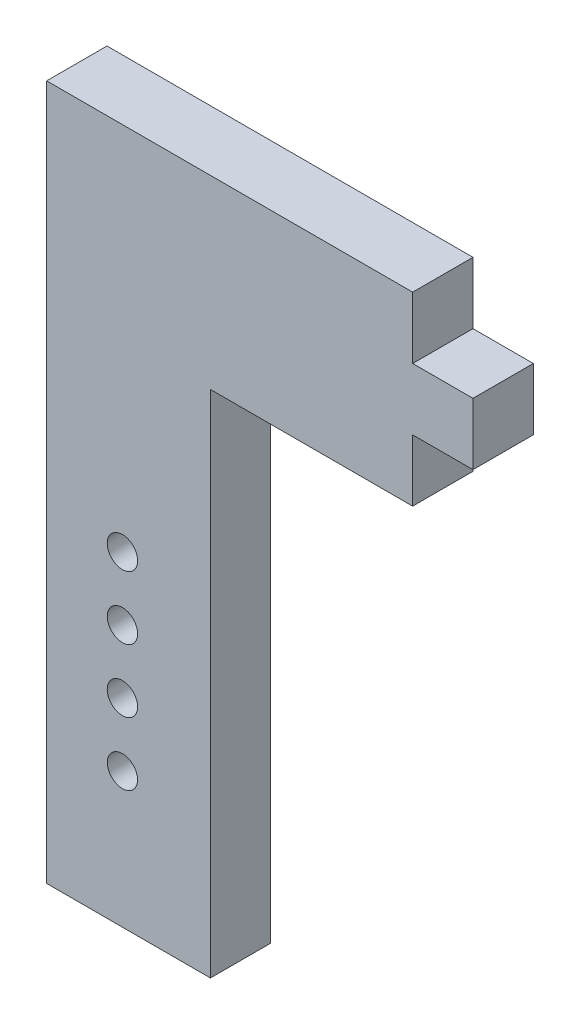
ISO-10303-21;
HEADER;
FILE_DESCRIPTION(('STEP AP214'),'2;1');
FILE_NAME('part.step','',(''),(''),'','','');
FILE_SCHEMA(('AUTOMOTIVE_DESIGN { 1 0 10303 214 1 1 1 1 }'));
ENDSEC;
DATA;
#1=APPLICATION_CONTEXT('core data for automotive mechanical design processes');
#2=APPLICATION_PROTOCOL_DEFINITION('international standard','automotive_design',2000,#1);
#3=PRODUCT_CONTEXT('',#1,'mechanical');
#4=PRODUCT('Part','Part','',(#3));
#5=PRODUCT_RELATED_PRODUCT_CATEGORY('part','',(#4));
#6=PRODUCT_DEFINITION_FORMATION('','',#4);
#7=PRODUCT_DEFINITION_CONTEXT('part definition',#1,'design');
#8=PRODUCT_DEFINITION('design','',#6,#7);
#9=PRODUCT_DEFINITION_SHAPE('','',#8);
#10=(LENGTH_UNIT() NAMED_UNIT(*) SI_UNIT(.MILLI.,.METRE.));
#11=(NAMED_UNIT(*) PLANE_ANGLE_UNIT() SI_UNIT($,.RADIAN.));
#12=(NAMED_UNIT(*) SI_UNIT($,.STERADIAN.) SOLID_ANGLE_UNIT());
#13=UNCERTAINTY_MEASURE_WITH_UNIT(LENGTH_MEASURE(1.E-05),#10,'distance_accuracy_value','');
#14=(GEOMETRIC_REPRESENTATION_CONTEXT(3) GLOBAL_UNCERTAINTY_ASSIGNED_CONTEXT((#13)) GLOBAL_UNIT_ASSIGNED_CONTEXT((#10,
#11,#12)) REPRESENTATION_CONTEXT('',''));
#15=CARTESIAN_POINT('',(0.,0.,0.));
#16=DIRECTION('',(0.,0.,1.));
#17=DIRECTION('',(1.,0.,0.));
#18=AXIS2_PLACEMENT_3D('',#15,#16,#17);
#19=CARTESIAN_POINT('',(-6.731,28.575,4.9609375));
#20=DIRECTION('',(0.,-1.,0.));
#21=DIRECTION('',(0.,0.,-1.));
#22=AXIS2_PLACEMENT_3D('',#19,#20,#21);
#23=PLANE('',#22);
#24=DIRECTION('',(0.,0.,1.));
#25=VECTOR('',#24,1.);
#26=CARTESIAN_POINT('',(23.3600625,28.575,4.9609375));
#27=LINE('',#26,#25);
#28=CARTESIAN_POINT('',(23.3600625,28.575,0.));
#29=VERTEX_POINT('',#28);
#30=CARTESIAN_POINT('',(23.3600625,28.575,4.9609375));
#31=VERTEX_POINT('',#30);
#32=EDGE_CURVE('E134',#29,#31,#27,.T.);
#33=ORIENTED_EDGE('',*,*,#32,.F.);
#34=DIRECTION('',(-1.,0.,0.));
#35=VECTOR('',#34,1.);
#36=CARTESIAN_POINT('',(-6.731,28.575,0.));
#37=LINE('',#36,#35);
#38=CARTESIAN_POINT('',(-6.731,28.575,0.));
#39=VERTEX_POINT('',#38);
#40=EDGE_CURVE('E133',#29,#39,#37,.T.);
#41=ORIENTED_EDGE('',*,*,#40,.T.);
#42=DIRECTION('',(0.,0.,-1.));
#43=VECTOR('',#42,1.);
#44=CARTESIAN_POINT('',(-6.731,28.575,4.9609375));
#45=LINE('',#44,#43);
#46=CARTESIAN_POINT('',(-6.731,28.575,4.9609375));
#47=VERTEX_POINT('',#46);
#48=EDGE_CURVE('E42',#47,#39,#45,.T.);
#49=ORIENTED_EDGE('',*,*,#48,.F.);
#50=DIRECTION('',(-1.,0.,0.));
#51=VECTOR('',#50,1.);
#52=CARTESIAN_POINT('',(-6.731,28.575,4.9609375));
#53=LINE('',#52,#51);
#54=EDGE_CURVE('E174',#31,#47,#53,.T.);
#55=ORIENTED_EDGE('',*,*,#54,.F.);
#56=EDGE_LOOP('',(#33,#41,#49,#55));
#57=FACE_BOUND('',#56,.T.);
#58=ADVANCED_FACE('F34',(#57),#23,.F.);
#59=CARTESIAN_POINT('',(0.,0.,4.9609375));
#60=DIRECTION('',(0.,0.,1.));
#61=DIRECTION('',(1.,0.,0.));
#62=AXIS2_PLACEMENT_3D('',#59,#60,#61);
#63=PLANE('',#62);
#64=DIRECTION('',(1.,0.,0.));
#65=VECTOR('',#64,1.);
#66=CARTESIAN_POINT('',(23.3600625,23.495,4.9609375));
#67=LINE('',#66,#65);
#68=CARTESIAN_POINT('',(23.3600625,23.495,4.9609375));
#69=VERTEX_POINT('',#68);
#70=CARTESIAN_POINT('',(28.321,23.495,4.9609375));
#71=VERTEX_POINT('',#70);
#72=EDGE_CURVE('E57',#69,#71,#67,.T.);
#73=ORIENTED_EDGE('',*,*,#72,.F.);
#74=DIRECTION('',(0.,1.,0.));
#75=VECTOR('',#74,1.);
#76=CARTESIAN_POINT('',(23.3600625,0.,4.9609375));
#77=LINE('',#76,#75);
#78=EDGE_CURVE('E126',#69,#31,#77,.T.);
#79=ORIENTED_EDGE('',*,*,#78,.T.);
#80=ORIENTED_EDGE('',*,*,#54,.T.);
#81=DIRECTION('',(0.,-1.,0.));
#82=VECTOR('',#81,1.);
#83=CARTESIAN_POINT('',(-6.731,28.575,4.9609375));
#84=LINE('',#83,#82);
#85=CARTESIAN_POINT('',(-6.731,-28.575,4.9609375));
#86=VERTEX_POINT('',#85);
#87=EDGE_CURVE('E177',#47,#86,#84,.T.);
#88=ORIENTED_EDGE('',*,*,#87,.T.);
#89=DIRECTION('',(1.,0.,0.));
#90=VECTOR('',#89,1.);
#91=CARTESIAN_POINT('',(-6.731,-28.575,4.9609375));
#92=LINE('',#91,#90);
#93=CARTESIAN_POINT('',(6.731,-28.575,4.9609375));
#94=VERTEX_POINT('',#93);
#95=EDGE_CURVE('E179',#86,#94,#92,.T.);
#96=ORIENTED_EDGE('',*,*,#95,.T.);
#97=DIRECTION('',(0.,1.,0.));
#98=VECTOR('',#97,1.);
#99=CARTESIAN_POINT('',(6.731,28.575,4.9609375));
#100=LINE('',#99,#98);
#101=CARTESIAN_POINT('',(6.731,13.335,4.9609375));
#102=VERTEX_POINT('',#101);
#103=EDGE_CURVE('E171',#94,#102,#100,.T.);
#104=ORIENTED_EDGE('',*,*,#103,.T.);
#105=DIRECTION('',(-1.,0.,0.));
#106=VECTOR('',#105,1.);
#107=CARTESIAN_POINT('',(28.321,13.335,4.9609375));
#108=LINE('',#107,#106);
#109=CARTESIAN_POINT('',(23.3600625,13.335,4.9609375));
#110=VERTEX_POINT('',#109);
#111=EDGE_CURVE('E159',#110,#102,#108,.T.);
#112=ORIENTED_EDGE('',*,*,#111,.F.);
#113=CARTESIAN_POINT('',(23.3600625,18.415,4.9609375));
#114=VERTEX_POINT('',#113);
#115=EDGE_CURVE('E135',#110,#114,#77,.T.);
#116=ORIENTED_EDGE('',*,*,#115,.T.);
#117=DIRECTION('',(1.,0.,0.));
#118=VECTOR('',#117,1.);
#119=CARTESIAN_POINT('',(23.3600625,18.415,4.9609375));
#120=LINE('',#119,#118);
#121=CARTESIAN_POINT('',(28.321,18.415,4.9609375));
#122=VERTEX_POINT('',#121);
#123=EDGE_CURVE('E144',#114,#122,#120,.T.);
#124=ORIENTED_EDGE('',*,*,#123,.T.);
#125=DIRECTION('',(0.,-1.,0.));
#126=VECTOR('',#125,1.);
#127=CARTESIAN_POINT('',(28.321,28.575,4.9609375));
#128=LINE('',#127,#126);
#129=EDGE_CURVE('E157',#71,#122,#128,.T.);
#130=ORIENTED_EDGE('',*,*,#129,.F.);
#131=EDGE_LOOP('',(#73,#79,#80,#88,#96,#104,#112,#116,#124,#130));
#132=FACE_BOUND('',#131,.T.);
#133=CARTESIAN_POINT('',(-0.50215382907749,-1.86249999999999,4.9609375));
#134=DIRECTION('',(0.,0.,-1.));
#135=DIRECTION('',(-1.,0.,0.));
#136=AXIS2_PLACEMENT_3D('',#133,#134,#135);
#137=CIRCLE('',#136,1.24968);
#138=CARTESIAN_POINT('',(-1.75183382907749,-1.86249999999999,4.9609375));
#139=VERTEX_POINT('',#138);
#140=EDGE_CURVE('E379',#139,#139,#137,.T.);
#141=ORIENTED_EDGE('',*,*,#140,.T.);
#142=EDGE_LOOP('',(#141));
#143=FACE_BOUND('',#142,.T.);
#144=CARTESIAN_POINT('',(-0.50215382907749,-7.06249999999999,4.9609375));
#145=DIRECTION('',(0.,0.,-1.));
#146=DIRECTION('',(-1.,0.,0.));
#147=AXIS2_PLACEMENT_3D('',#144,#145,#146);
#148=CIRCLE('',#147,1.24968);
#149=CARTESIAN_POINT('',(-1.75183382907749,-7.06249999999999,4.9609375));
#150=VERTEX_POINT('',#149);
#151=EDGE_CURVE('E369',#150,#150,#148,.T.);
#152=ORIENTED_EDGE('',*,*,#151,.T.);
#153=EDGE_LOOP('',(#152));
#154=FACE_BOUND('',#153,.T.);
#155=CARTESIAN_POINT('',(-0.502153829077487,-17.4625,4.9609375));
#156=DIRECTION('',(0.,0.,-1.));
#157=DIRECTION('',(-1.,0.,0.));
#158=AXIS2_PLACEMENT_3D('',#155,#156,#157);
#159=CIRCLE('',#158,1.2446);
#160=CARTESIAN_POINT('',(-1.74675382907749,-17.4625,4.9609375));
#161=VERTEX_POINT('',#160);
#162=EDGE_CURVE('E364',#161,#161,#159,.T.);
#163=ORIENTED_EDGE('',*,*,#162,.T.);
#164=EDGE_LOOP('',(#163));
#165=FACE_BOUND('',#164,.T.);
#166=CARTESIAN_POINT('',(-0.50215382907749,-12.2625,4.9609375));
#167=DIRECTION('',(0.,0.,-1.));
#168=DIRECTION('',(-1.,0.,0.));
#169=AXIS2_PLACEMENT_3D('',#166,#167,#168);
#170=CIRCLE('',#169,1.25);
#171=CARTESIAN_POINT('',(-1.75215382907749,-12.2625,4.9609375));
#172=VERTEX_POINT('',#171);
#173=EDGE_CURVE('E167',#172,#172,#170,.T.);
#174=ORIENTED_EDGE('',*,*,#173,.T.);
#175=EDGE_LOOP('',(#174));
#176=FACE_BOUND('',#175,.T.);
#177=ADVANCED_FACE('F211',(#132,#143,#154,#165,#176),#63,.T.);
#178=CARTESIAN_POINT('',(0.,0.,0.));
#179=DIRECTION('',(0.,0.,1.));
#180=DIRECTION('',(1.,0.,0.));
#181=AXIS2_PLACEMENT_3D('',#178,#179,#180);
#182=PLANE('',#181);
#183=DIRECTION('',(1.,0.,0.));
#184=VECTOR('',#183,1.);
#185=CARTESIAN_POINT('',(23.3600625,18.415,0.));
#186=LINE('',#185,#184);
#187=CARTESIAN_POINT('',(23.3600625,18.415,0.));
#188=VERTEX_POINT('',#187);
#189=CARTESIAN_POINT('',(28.321,18.415,0.));
#190=VERTEX_POINT('',#189);
#191=EDGE_CURVE('E49',#188,#190,#186,.T.);
#192=ORIENTED_EDGE('',*,*,#191,.F.);
#193=DIRECTION('',(0.,1.,0.));
#194=VECTOR('',#193,1.);
#195=CARTESIAN_POINT('',(23.3600625,0.,0.));
#196=LINE('',#195,#194);
#197=CARTESIAN_POINT('',(23.3600625,13.335,0.));
#198=VERTEX_POINT('',#197);
#199=EDGE_CURVE('E137',#198,#188,#196,.T.);
#200=ORIENTED_EDGE('',*,*,#199,.F.);
#201=DIRECTION('',(-1.,0.,0.));
#202=VECTOR('',#201,1.);
#203=CARTESIAN_POINT('',(28.321,13.335,0.));
#204=LINE('',#203,#202);
#205=CARTESIAN_POINT('',(6.731,13.335,0.));
#206=VERTEX_POINT('',#205);
#207=EDGE_CURVE('E156',#198,#206,#204,.T.);
#208=ORIENTED_EDGE('',*,*,#207,.T.);
#209=DIRECTION('',(0.,1.,0.));
#210=VECTOR('',#209,1.);
#211=CARTESIAN_POINT('',(6.731,28.575,0.));
#212=LINE('',#211,#210);
#213=CARTESIAN_POINT('',(6.731,-28.575,0.));
#214=VERTEX_POINT('',#213);
#215=EDGE_CURVE('E170',#214,#206,#212,.T.);
#216=ORIENTED_EDGE('',*,*,#215,.F.);
#217=DIRECTION('',(1.,0.,0.));
#218=VECTOR('',#217,1.);
#219=CARTESIAN_POINT('',(-6.731,-28.575,0.));
#220=LINE('',#219,#218);
#221=CARTESIAN_POINT('',(-6.731,-28.575,0.));
#222=VERTEX_POINT('',#221);
#223=EDGE_CURVE('E175',#222,#214,#220,.T.);
#224=ORIENTED_EDGE('',*,*,#223,.F.);
#225=DIRECTION('',(0.,-1.,0.));
#226=VECTOR('',#225,1.);
#227=CARTESIAN_POINT('',(-6.731,28.575,0.));
#228=LINE('',#227,#226);
#229=EDGE_CURVE('E185',#39,#222,#228,.T.);
#230=ORIENTED_EDGE('',*,*,#229,.F.);
#231=ORIENTED_EDGE('',*,*,#40,.F.);
#232=CARTESIAN_POINT('',(23.3600625,23.495,0.));
#233=VERTEX_POINT('',#232);
#234=EDGE_CURVE('E123',#233,#29,#196,.T.);
#235=ORIENTED_EDGE('',*,*,#234,.F.);
#236=DIRECTION('',(1.,0.,0.));
#237=VECTOR('',#236,1.);
#238=CARTESIAN_POINT('',(23.3600625,23.495,0.));
#239=LINE('',#238,#237);
#240=CARTESIAN_POINT('',(28.321,23.495,0.));
#241=VERTEX_POINT('',#240);
#242=EDGE_CURVE('E110',#233,#241,#239,.T.);
#243=ORIENTED_EDGE('',*,*,#242,.T.);
#244=DIRECTION('',(0.,1.,0.));
#245=VECTOR('',#244,1.);
#246=CARTESIAN_POINT('',(28.321,28.575,0.));
#247=LINE('',#246,#245);
#248=EDGE_CURVE('E154',#190,#241,#247,.T.);
#249=ORIENTED_EDGE('',*,*,#248,.F.);
#250=EDGE_LOOP('',(#192,#200,#208,#216,#224,#230,#231,#235,#243,#249));
#251=FACE_BOUND('',#250,.T.);
#252=CARTESIAN_POINT('',(-0.50215382907749,-12.2625,0.));
#253=DIRECTION('',(0.,0.,-1.));
#254=DIRECTION('',(-1.,0.,0.));
#255=AXIS2_PLACEMENT_3D('',#252,#253,#254);
#256=CIRCLE('',#255,1.25);
#257=CARTESIAN_POINT('',(-1.75215382907749,-12.2625,0.));
#258=VERTEX_POINT('',#257);
#259=EDGE_CURVE('E371',#258,#258,#256,.T.);
#260=ORIENTED_EDGE('',*,*,#259,.F.);
#261=EDGE_LOOP('',(#260));
#262=FACE_BOUND('',#261,.T.);
#263=CARTESIAN_POINT('',(-0.502153829077487,-17.4625,0.));
#264=DIRECTION('',(0.,0.,-1.));
#265=DIRECTION('',(-1.,0.,0.));
#266=AXIS2_PLACEMENT_3D('',#263,#264,#265);
#267=CIRCLE('',#266,1.2446);
#268=CARTESIAN_POINT('',(-1.74675382907749,-17.4625,0.));
#269=VERTEX_POINT('',#268);
#270=EDGE_CURVE('E367',#269,#269,#267,.T.);
#271=ORIENTED_EDGE('',*,*,#270,.F.);
#272=EDGE_LOOP('',(#271));
#273=FACE_BOUND('',#272,.T.);
#274=CARTESIAN_POINT('',(-0.50215382907749,-7.06249999999999,0.));
#275=DIRECTION('',(0.,0.,-1.));
#276=DIRECTION('',(-1.,0.,0.));
#277=AXIS2_PLACEMENT_3D('',#274,#275,#276);
#278=CIRCLE('',#277,1.24968);
#279=CARTESIAN_POINT('',(-1.75183382907749,-7.06249999999999,0.));
#280=VERTEX_POINT('',#279);
#281=EDGE_CURVE('E374',#280,#280,#278,.T.);
#282=ORIENTED_EDGE('',*,*,#281,.F.);
#283=EDGE_LOOP('',(#282));
#284=FACE_BOUND('',#283,.T.);
#285=CARTESIAN_POINT('',(-0.50215382907749,-1.86249999999999,0.));
#286=DIRECTION('',(0.,0.,-1.));
#287=DIRECTION('',(-1.,0.,0.));
#288=AXIS2_PLACEMENT_3D('',#285,#286,#287);
#289=CIRCLE('',#288,1.24968);
#290=CARTESIAN_POINT('',(-1.75183382907749,-1.86249999999999,0.));
#291=VERTEX_POINT('',#290);
#292=EDGE_CURVE('E382',#291,#291,#289,.T.);
#293=ORIENTED_EDGE('',*,*,#292,.F.);
#294=EDGE_LOOP('',(#293));
#295=FACE_BOUND('',#294,.T.);
#296=ADVANCED_FACE('F130',(#251,#262,#273,#284,#295),#182,.F.);
#297=CARTESIAN_POINT('',(28.321,13.335,4.9609375));
#298=DIRECTION('',(0.,1.,0.));
#299=DIRECTION('',(-1.,0.,0.));
#300=AXIS2_PLACEMENT_3D('',#297,#298,#299);
#301=PLANE('',#300);
#302=DIRECTION('',(0.,0.,-1.));
#303=VECTOR('',#302,1.);
#304=CARTESIAN_POINT('',(23.3600625,13.335,4.9609375));
#305=LINE('',#304,#303);
#306=EDGE_CURVE('E12',#110,#198,#305,.T.);
#307=ORIENTED_EDGE('',*,*,#306,.F.);
#308=ORIENTED_EDGE('',*,*,#111,.T.);
#309=DIRECTION('',(0.,0.,-1.));
#310=VECTOR('',#309,1.);
#311=CARTESIAN_POINT('',(6.731,13.335,4.9609375));
#312=LINE('',#311,#310);
#313=EDGE_CURVE('E162',#102,#206,#312,.T.);
#314=ORIENTED_EDGE('',*,*,#313,.T.);
#315=ORIENTED_EDGE('',*,*,#207,.F.);
#316=EDGE_LOOP('',(#307,#308,#314,#315));
#317=FACE_BOUND('',#316,.T.);
#318=ADVANCED_FACE('F225',(#317),#301,.F.);
#319=CARTESIAN_POINT('',(28.321,0.,0.));
#320=DIRECTION('',(1.,0.,0.));
#321=DIRECTION('',(0.,1.,0.));
#322=AXIS2_PLACEMENT_3D('',#319,#320,#321);
#323=PLANE('',#322);
#324=ORIENTED_EDGE('',*,*,#129,.T.);
#325=DIRECTION('',(0.,0.,-1.));
#326=VECTOR('',#325,1.);
#327=CARTESIAN_POINT('',(28.321,18.415,4.9609375));
#328=LINE('',#327,#326);
#329=EDGE_CURVE('E127',#122,#190,#328,.T.);
#330=ORIENTED_EDGE('',*,*,#329,.T.);
#331=ORIENTED_EDGE('',*,*,#248,.T.);
#332=DIRECTION('',(0.,0.,1.));
#333=VECTOR('',#332,1.);
#334=CARTESIAN_POINT('',(28.321,23.495,4.9609375));
#335=LINE('',#334,#333);
#336=EDGE_CURVE('E114',#241,#71,#335,.T.);
#337=ORIENTED_EDGE('',*,*,#336,.T.);
#338=EDGE_LOOP('',(#324,#330,#331,#337));
#339=FACE_BOUND('',#338,.T.);
#340=ADVANCED_FACE('F229',(#339),#323,.T.);
#341=CARTESIAN_POINT('',(6.731,28.575,4.9609375));
#342=DIRECTION('',(-1.,0.,0.));
#343=DIRECTION('',(0.,-1.,0.));
#344=AXIS2_PLACEMENT_3D('',#341,#342,#343);
#345=PLANE('',#344);
#346=ORIENTED_EDGE('',*,*,#313,.F.);
#347=ORIENTED_EDGE('',*,*,#103,.F.);
#348=DIRECTION('',(0.,0.,-1.));
#349=VECTOR('',#348,1.);
#350=CARTESIAN_POINT('',(6.731,-28.575,4.9609375));
#351=LINE('',#350,#349);
#352=EDGE_CURVE('E181',#94,#214,#351,.T.);
#353=ORIENTED_EDGE('',*,*,#352,.T.);
#354=ORIENTED_EDGE('',*,*,#215,.T.);
#355=EDGE_LOOP('',(#346,#347,#353,#354));
#356=FACE_BOUND('',#355,.T.);
#357=ADVANCED_FACE('F36',(#356),#345,.F.);
#358=CARTESIAN_POINT('',(-6.731,28.575,4.9609375));
#359=DIRECTION('',(1.,0.,0.));
#360=DIRECTION('',(0.,1.,0.));
#361=AXIS2_PLACEMENT_3D('',#358,#359,#360);
#362=PLANE('',#361);
#363=ORIENTED_EDGE('',*,*,#229,.T.);
#364=DIRECTION('',(0.,0.,-1.));
#365=VECTOR('',#364,1.);
#366=CARTESIAN_POINT('',(-6.731,-28.575,4.9609375));
#367=LINE('',#366,#365);
#368=EDGE_CURVE('E190',#86,#222,#367,.T.);
#369=ORIENTED_EDGE('',*,*,#368,.F.);
#370=ORIENTED_EDGE('',*,*,#87,.F.);
#371=ORIENTED_EDGE('',*,*,#48,.T.);
#372=EDGE_LOOP('',(#363,#369,#370,#371));
#373=FACE_BOUND('',#372,.T.);
#374=ADVANCED_FACE('F196',(#373),#362,.F.);
#375=CARTESIAN_POINT('',(-6.731,-28.575,4.9609375));
#376=DIRECTION('',(0.,1.,0.));
#377=DIRECTION('',(0.,0.,1.));
#378=AXIS2_PLACEMENT_3D('',#375,#376,#377);
#379=PLANE('',#378);
#380=ORIENTED_EDGE('',*,*,#223,.T.);
#381=ORIENTED_EDGE('',*,*,#352,.F.);
#382=ORIENTED_EDGE('',*,*,#95,.F.);
#383=ORIENTED_EDGE('',*,*,#368,.T.);
#384=EDGE_LOOP('',(#380,#381,#382,#383));
#385=FACE_BOUND('',#384,.T.);
#386=ADVANCED_FACE('F204',(#385),#379,.F.);
#387=CARTESIAN_POINT('',(-0.50215382907749,-12.2625,4.9609375));
#388=DIRECTION('',(0.,0.,-1.));
#389=DIRECTION('',(-1.,0.,0.));
#390=AXIS2_PLACEMENT_3D('',#387,#388,#389);
#391=CYLINDRICAL_SURFACE('',#390,1.25);
#392=ORIENTED_EDGE('',*,*,#173,.F.);
#393=EDGE_LOOP('',(#392));
#394=FACE_BOUND('',#393,.T.);
#395=ORIENTED_EDGE('',*,*,#259,.T.);
#396=EDGE_LOOP('',(#395));
#397=FACE_BOUND('',#396,.T.);
#398=ADVANCED_FACE('F223',(#394,#397),#391,.F.);
#399=CARTESIAN_POINT('',(-0.502153829077487,-17.4625,4.9609375));
#400=DIRECTION('',(0.,0.,-1.));
#401=DIRECTION('',(-1.,0.,0.));
#402=AXIS2_PLACEMENT_3D('',#399,#400,#401);
#403=CYLINDRICAL_SURFACE('',#402,1.2446);
#404=ORIENTED_EDGE('',*,*,#162,.F.);
#405=EDGE_LOOP('',(#404));
#406=FACE_BOUND('',#405,.T.);
#407=ORIENTED_EDGE('',*,*,#270,.T.);
#408=EDGE_LOOP('',(#407));
#409=FACE_BOUND('',#408,.T.);
#410=ADVANCED_FACE('F235',(#406,#409),#403,.F.);
#411=CARTESIAN_POINT('',(-0.50215382907749,-7.06249999999999,4.9609375));
#412=DIRECTION('',(0.,0.,-1.));
#413=DIRECTION('',(-1.,0.,0.));
#414=AXIS2_PLACEMENT_3D('',#411,#412,#413);
#415=CYLINDRICAL_SURFACE('',#414,1.24968);
#416=ORIENTED_EDGE('',*,*,#151,.F.);
#417=EDGE_LOOP('',(#416));
#418=FACE_BOUND('',#417,.T.);
#419=ORIENTED_EDGE('',*,*,#281,.T.);
#420=EDGE_LOOP('',(#419));
#421=FACE_BOUND('',#420,.T.);
#422=ADVANCED_FACE('F240',(#418,#421),#415,.F.);
#423=CARTESIAN_POINT('',(-0.50215382907749,-1.86249999999999,4.9609375));
#424=DIRECTION('',(0.,0.,-1.));
#425=DIRECTION('',(-1.,0.,0.));
#426=AXIS2_PLACEMENT_3D('',#423,#424,#425);
#427=CYLINDRICAL_SURFACE('',#426,1.24968);
#428=ORIENTED_EDGE('',*,*,#140,.F.);
#429=EDGE_LOOP('',(#428));
#430=FACE_BOUND('',#429,.T.);
#431=ORIENTED_EDGE('',*,*,#292,.T.);
#432=EDGE_LOOP('',(#431));
#433=FACE_BOUND('',#432,.T.);
#434=ADVANCED_FACE('F237',(#430,#433),#427,.F.);
#435=CARTESIAN_POINT('',(23.3600625,23.495,4.9609375));
#436=DIRECTION('',(0.,1.,0.));
#437=DIRECTION('',(-1.,0.,0.));
#438=AXIS2_PLACEMENT_3D('',#435,#436,#437);
#439=PLANE('',#438);
#440=ORIENTED_EDGE('',*,*,#336,.F.);
#441=ORIENTED_EDGE('',*,*,#242,.F.);
#442=DIRECTION('',(0.,0.,1.));
#443=VECTOR('',#442,1.);
#444=CARTESIAN_POINT('',(23.3600625,23.495,4.9609375));
#445=LINE('',#444,#443);
#446=EDGE_CURVE('E113',#233,#69,#445,.T.);
#447=ORIENTED_EDGE('',*,*,#446,.T.);
#448=ORIENTED_EDGE('',*,*,#72,.T.);
#449=EDGE_LOOP('',(#440,#441,#447,#448));
#450=FACE_BOUND('',#449,.T.);
#451=ADVANCED_FACE('F112',(#450),#439,.T.);
#452=CARTESIAN_POINT('',(23.3600625,0.,2.48046875));
#453=DIRECTION('',(1.,0.,0.));
#454=DIRECTION('',(0.,1.,0.));
#455=AXIS2_PLACEMENT_3D('',#452,#453,#454);
#456=PLANE('',#455);
#457=ORIENTED_EDGE('',*,*,#446,.F.);
#458=ORIENTED_EDGE('',*,*,#234,.T.);
#459=ORIENTED_EDGE('',*,*,#32,.T.);
#460=ORIENTED_EDGE('',*,*,#78,.F.);
#461=EDGE_LOOP('',(#457,#458,#459,#460));
#462=FACE_BOUND('',#461,.T.);
#463=ADVANCED_FACE('F122',(#462),#456,.T.);
#464=ORIENTED_EDGE('',*,*,#306,.T.);
#465=ORIENTED_EDGE('',*,*,#199,.T.);
#466=DIRECTION('',(0.,0.,-1.));
#467=VECTOR('',#466,1.);
#468=CARTESIAN_POINT('',(23.3600625,18.415,4.9609375));
#469=LINE('',#468,#467);
#470=EDGE_CURVE('E119',#114,#188,#469,.T.);
#471=ORIENTED_EDGE('',*,*,#470,.F.);
#472=ORIENTED_EDGE('',*,*,#115,.F.);
#473=EDGE_LOOP('',(#464,#465,#471,#472));
#474=FACE_BOUND('',#473,.T.);
#475=ADVANCED_FACE('F248',(#474),#456,.T.);
#476=CARTESIAN_POINT('',(23.3600625,18.415,4.9609375));
#477=DIRECTION('',(0.,-1.,0.));
#478=DIRECTION('',(1.,0.,0.));
#479=AXIS2_PLACEMENT_3D('',#476,#477,#478);
#480=PLANE('',#479);
#481=ORIENTED_EDGE('',*,*,#329,.F.);
#482=ORIENTED_EDGE('',*,*,#123,.F.);
#483=ORIENTED_EDGE('',*,*,#470,.T.);
#484=ORIENTED_EDGE('',*,*,#191,.T.);
#485=EDGE_LOOP('',(#481,#482,#483,#484));
#486=FACE_BOUND('',#485,.T.);
#487=ADVANCED_FACE('F152',(#486),#480,.T.);
#488=CLOSED_SHELL('',(#58,#177,#296,#318,#340,#357,#374,#386,#398,#410,#422,#434,#451,#463,#475,#487));
#489=MANIFOLD_SOLID_BREP('B2',#488);
#490=ADVANCED_BREP_SHAPE_REPRESENTATION('',(#18,#489),#14);
#491=SHAPE_DEFINITION_REPRESENTATION(#9,#490);
ENDSEC;
END-ISO-10303-21;
